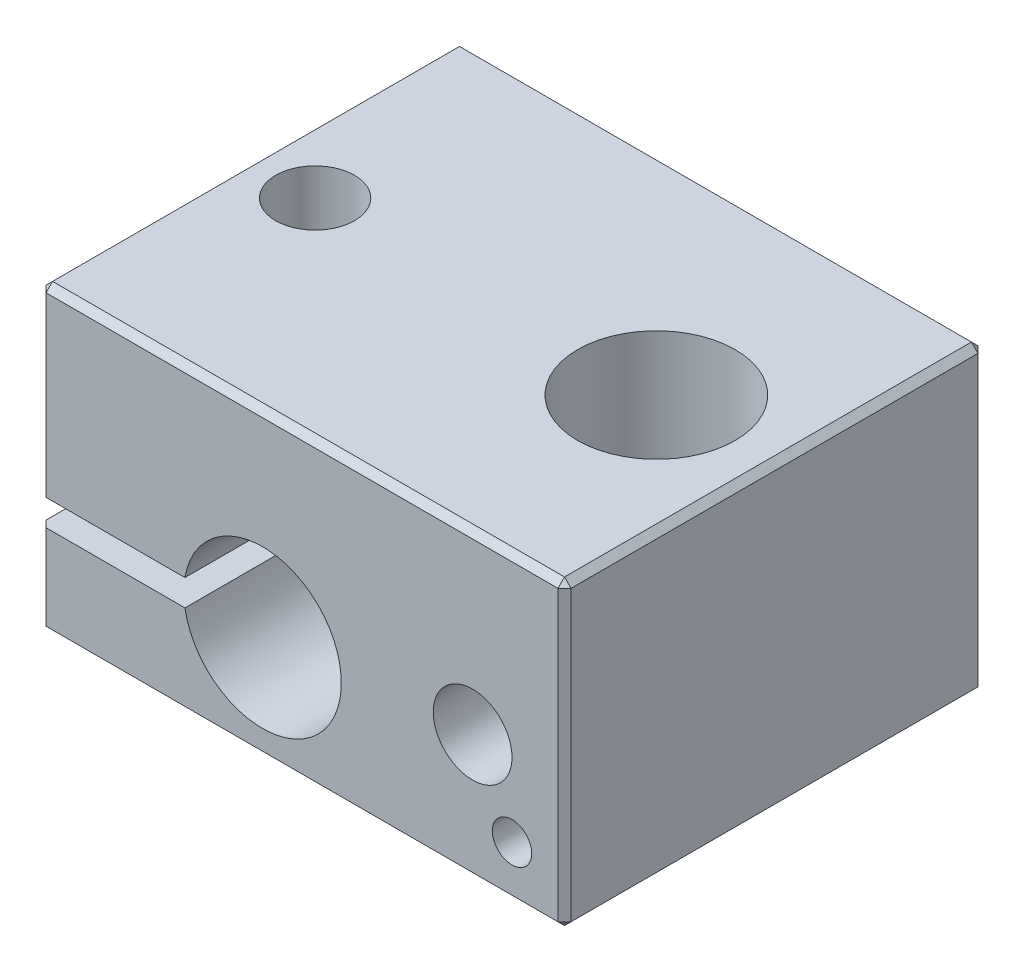
ISO-10303-21;
HEADER;
FILE_DESCRIPTION(('STEP AP214'),'2;1');
FILE_NAME('part.step','',(''),(''),'','','');
FILE_SCHEMA(('AUTOMOTIVE_DESIGN { 1 0 10303 214 1 1 1 1 }'));
ENDSEC;
DATA;
#1=APPLICATION_CONTEXT('core data for automotive mechanical design processes');
#2=APPLICATION_PROTOCOL_DEFINITION('international standard','automotive_design',2000,#1);
#3=PRODUCT_CONTEXT('',#1,'mechanical');
#4=PRODUCT('Part','Part','',(#3));
#5=PRODUCT_RELATED_PRODUCT_CATEGORY('part','',(#4));
#6=PRODUCT_DEFINITION_FORMATION('','',#4);
#7=PRODUCT_DEFINITION_CONTEXT('part definition',#1,'design');
#8=PRODUCT_DEFINITION('design','',#6,#7);
#9=PRODUCT_DEFINITION_SHAPE('','',#8);
#10=(LENGTH_UNIT() NAMED_UNIT(*) SI_UNIT(.MILLI.,.METRE.));
#11=(NAMED_UNIT(*) PLANE_ANGLE_UNIT() SI_UNIT($,.RADIAN.));
#12=(NAMED_UNIT(*) SI_UNIT($,.STERADIAN.) SOLID_ANGLE_UNIT());
#13=UNCERTAINTY_MEASURE_WITH_UNIT(LENGTH_MEASURE(1.E-05),#10,'distance_accuracy_value','');
#14=(GEOMETRIC_REPRESENTATION_CONTEXT(3) GLOBAL_UNCERTAINTY_ASSIGNED_CONTEXT((#13)) GLOBAL_UNIT_ASSIGNED_CONTEXT((#10,
#11,#12)) REPRESENTATION_CONTEXT('',''));
#15=CARTESIAN_POINT('',(0.,0.,0.));
#16=DIRECTION('',(0.,0.,1.));
#17=DIRECTION('',(1.,0.,0.));
#18=AXIS2_PLACEMENT_3D('',#15,#16,#17);
#19=CARTESIAN_POINT('',(7.24900000000001,1.249,3.49999999999999));
#20=DIRECTION('',(0.,0.,1.));
#21=DIRECTION('',(1.,0.,0.));
#22=AXIS2_PLACEMENT_3D('',#19,#20,#21);
#23=PLANE('',#22);
#24=CARTESIAN_POINT('',(8.00000000000001,2.,3.49999999999999));
#25=DIRECTION('',(0.,0.,1.));
#26=DIRECTION('',(0.,-1.,0.));
#27=AXIS2_PLACEMENT_3D('',#24,#25,#26);
#28=CIRCLE('',#27,0.75);
#29=CARTESIAN_POINT('',(8.00000000000001,1.25,3.49999999999999));
#30=VERTEX_POINT('',#29);
#31=EDGE_CURVE('E20',#30,#30,#28,.F.);
#32=ORIENTED_EDGE('',*,*,#31,.F.);
#33=EDGE_LOOP('',(#32));
#34=FACE_BOUND('',#33,.T.);
#35=ADVANCED_FACE('F16',(#34),#23,.T.);
#36=CARTESIAN_POINT('',(4.99900000000001,3.299,4.49999999999999));
#37=DIRECTION('',(0.,0.,1.));
#38=DIRECTION('',(1.,0.,0.));
#39=AXIS2_PLACEMENT_3D('',#36,#37,#38);
#40=PLANE('',#39);
#41=CARTESIAN_POINT('',(6.50000000000001,4.8,4.49999999999999));
#42=DIRECTION('',(0.,0.,1.));
#43=DIRECTION('',(1.,0.,0.));
#44=AXIS2_PLACEMENT_3D('',#41,#42,#43);
#45=CIRCLE('',#44,1.5);
#46=CARTESIAN_POINT('',(8.00000000000001,4.8,4.49999999999999));
#47=VERTEX_POINT('',#46);
#48=EDGE_CURVE('E287',#47,#47,#45,.F.);
#49=ORIENTED_EDGE('',*,*,#48,.F.);
#50=EDGE_LOOP('',(#49));
#51=FACE_BOUND('',#50,.T.);
#52=ADVANCED_FACE('F303',(#51),#40,.T.);
#53=CARTESIAN_POINT('',(-9.74929289321881,0.248999999999997,8.00070710678118));
#54=DIRECTION('',(-0.707106781186515,0.,0.70710678118658));
#55=DIRECTION('',(0.,1.,0.));
#56=AXIS2_PLACEMENT_3D('',#53,#54,#55);
#57=PLANE('',#56);
#58=DIRECTION('',(-0.70710678118649,0.,-0.707106781186605));
#59=VECTOR('',#58,1.);
#60=CARTESIAN_POINT('',(-9.75000000000001,0.249999999999989,8.));
#61=LINE('',#60,#59);
#62=CARTESIAN_POINT('',(-9.75000000000001,0.249999999999994,7.99999999999999));
#63=VERTEX_POINT('',#62);
#64=CARTESIAN_POINT('',(-10.,0.249999999999987,7.74999999999997));
#65=VERTEX_POINT('',#64);
#66=EDGE_CURVE('E277',#63,#65,#61,.T.);
#67=ORIENTED_EDGE('',*,*,#66,.F.);
#68=DIRECTION('',(0.,-1.,0.));
#69=VECTOR('',#68,1.);
#70=CARTESIAN_POINT('',(-9.75,5.75,7.99999999999999));
#71=LINE('',#70,#69);
#72=CARTESIAN_POINT('',(-9.75,3.5,7.99999999999999));
#73=VERTEX_POINT('',#72);
#74=EDGE_CURVE('E221',#73,#63,#71,.T.);
#75=ORIENTED_EDGE('',*,*,#74,.F.);
#76=DIRECTION('',(0.70710678118655,0.,0.707106781186545));
#77=VECTOR('',#76,1.);
#78=CARTESIAN_POINT('',(-10.,3.5,7.74999999999999));
#79=LINE('',#78,#77);
#80=CARTESIAN_POINT('',(-10.,3.5,7.74999999999999));
#81=VERTEX_POINT('',#80);
#82=EDGE_CURVE('E274',#81,#73,#79,.T.);
#83=ORIENTED_EDGE('',*,*,#82,.F.);
#84=DIRECTION('',(0.,1.,0.));
#85=VECTOR('',#84,1.);
#86=CARTESIAN_POINT('',(-9.99999999999999,1.875,7.74999999999999));
#87=LINE('',#86,#85);
#88=EDGE_CURVE('E280',#65,#81,#87,.T.);
#89=ORIENTED_EDGE('',*,*,#88,.F.);
#90=EDGE_LOOP('',(#67,#75,#83,#89));
#91=FACE_BOUND('',#90,.T.);
#92=ADVANCED_FACE('F309',(#91),#57,.T.);
#93=CARTESIAN_POINT('',(8.00000000000001,2.,3.49999999999999));
#94=DIRECTION('',(0.,0.,1.));
#95=DIRECTION('',(0.,-1.,0.));
#96=AXIS2_PLACEMENT_3D('',#93,#94,#95);
#97=CYLINDRICAL_SURFACE('',#96,0.75);
#98=CARTESIAN_POINT('',(8.00000000000001,2.,7.99999999999999));
#99=DIRECTION('',(0.,0.,1.));
#100=DIRECTION('',(0.,-1.,0.));
#101=AXIS2_PLACEMENT_3D('',#98,#99,#100);
#102=CIRCLE('',#101,0.75);
#103=CARTESIAN_POINT('',(8.00000000000001,1.25,7.99999999999999));
#104=VERTEX_POINT('',#103);
#105=EDGE_CURVE('E260',#104,#104,#102,.F.);
#106=ORIENTED_EDGE('',*,*,#105,.F.);
#107=EDGE_LOOP('',(#106));
#108=FACE_BOUND('',#107,.T.);
#109=ORIENTED_EDGE('',*,*,#31,.T.);
#110=EDGE_LOOP('',(#109));
#111=FACE_BOUND('',#110,.T.);
#112=ADVANCED_FACE('F300',(#108,#111),#97,.F.);
#113=CARTESIAN_POINT('',(6.50000000000001,4.8,4.49999999999999));
#114=DIRECTION('',(0.,0.,1.));
#115=DIRECTION('',(1.,0.,0.));
#116=AXIS2_PLACEMENT_3D('',#113,#114,#115);
#117=CYLINDRICAL_SURFACE('',#116,1.5);
#118=CARTESIAN_POINT('',(6.50000000000001,4.8,7.99999999999999));
#119=DIRECTION('',(0.,0.,1.));
#120=DIRECTION('',(1.,0.,0.));
#121=AXIS2_PLACEMENT_3D('',#118,#119,#120);
#122=CIRCLE('',#121,1.5);
#123=CARTESIAN_POINT('',(8.00000000000001,4.8,7.99999999999999));
#124=VERTEX_POINT('',#123);
#125=EDGE_CURVE('E256',#124,#124,#122,.F.);
#126=ORIENTED_EDGE('',*,*,#125,.F.);
#127=EDGE_LOOP('',(#126));
#128=FACE_BOUND('',#127,.T.);
#129=ORIENTED_EDGE('',*,*,#48,.T.);
#130=EDGE_LOOP('',(#129));
#131=FACE_BOUND('',#130,.T.);
#132=ADVANCED_FACE('F659',(#128,#131),#117,.F.);
#133=CARTESIAN_POINT('',(10.0007071067812,0.248999999999997,7.74929289321881));
#134=DIRECTION('',(0.707106781186527,0.,0.707106781186568));
#135=DIRECTION('',(0.,1.,0.));
#136=AXIS2_PLACEMENT_3D('',#133,#134,#135);
#137=PLANE('',#136);
#138=DIRECTION('',(-0.707106781186527,0.,0.707106781186568));
#139=VECTOR('',#138,1.);
#140=CARTESIAN_POINT('',(9.99999999999999,0.250000000000006,7.74999999999999));
#141=LINE('',#140,#139);
#142=CARTESIAN_POINT('',(10.,0.249999999999992,7.74999999999999));
#143=VERTEX_POINT('',#142);
#144=CARTESIAN_POINT('',(9.75000000000001,0.249999999999994,7.99999999999999));
#145=VERTEX_POINT('',#144);
#146=EDGE_CURVE('E185',#143,#145,#141,.T.);
#147=ORIENTED_EDGE('',*,*,#146,.F.);
#148=DIRECTION('',(0.,-1.,0.));
#149=VECTOR('',#148,1.);
#150=CARTESIAN_POINT('',(10.,5.75,7.75));
#151=LINE('',#150,#149);
#152=CARTESIAN_POINT('',(10.,11.25,7.75000000000001));
#153=VERTEX_POINT('',#152);
#154=EDGE_CURVE('E174',#153,#143,#151,.T.);
#155=ORIENTED_EDGE('',*,*,#154,.F.);
#156=DIRECTION('',(0.707106781186605,0.,-0.70710678118649));
#157=VECTOR('',#156,1.);
#158=CARTESIAN_POINT('',(9.87500000000003,11.25,7.875));
#159=LINE('',#158,#157);
#160=CARTESIAN_POINT('',(9.75000000000001,11.25,7.99999999999999));
#161=VERTEX_POINT('',#160);
#162=EDGE_CURVE('E212',#161,#153,#159,.T.);
#163=ORIENTED_EDGE('',*,*,#162,.F.);
#164=DIRECTION('',(0.,1.,0.));
#165=VECTOR('',#164,1.);
#166=CARTESIAN_POINT('',(9.75000000000001,5.75,7.99999999999999));
#167=LINE('',#166,#165);
#168=EDGE_CURVE('E216',#145,#161,#167,.T.);
#169=ORIENTED_EDGE('',*,*,#168,.F.);
#170=EDGE_LOOP('',(#147,#155,#163,#169));
#171=FACE_BOUND('',#170,.T.);
#172=ADVANCED_FACE('F538',(#171),#137,.T.);
#173=CARTESIAN_POINT('',(-10.0007071067812,0.248999999999997,-7.74929289321882));
#174=DIRECTION('',(-0.707106781186529,0.,-0.707106781186566));
#175=DIRECTION('',(0.,1.,0.));
#176=AXIS2_PLACEMENT_3D('',#173,#174,#175);
#177=PLANE('',#176);
#178=DIRECTION('',(0.707106781186529,0.,-0.707106781186566));
#179=VECTOR('',#178,1.);
#180=CARTESIAN_POINT('',(-9.99999999999999,0.250000000000006,-7.75));
#181=LINE('',#180,#179);
#182=CARTESIAN_POINT('',(-10.,0.249999999999989,-7.75));
#183=VERTEX_POINT('',#182);
#184=CARTESIAN_POINT('',(-9.75,0.250000000000001,-8.00000000000001));
#185=VERTEX_POINT('',#184);
#186=EDGE_CURVE('E281',#183,#185,#181,.T.);
#187=ORIENTED_EDGE('',*,*,#186,.F.);
#188=DIRECTION('',(0.,-1.,0.));
#189=VECTOR('',#188,1.);
#190=CARTESIAN_POINT('',(-10.,1.875,-7.75000000000001));
#191=LINE('',#190,#189);
#192=CARTESIAN_POINT('',(-10.,3.5,-7.75000000000001));
#193=VERTEX_POINT('',#192);
#194=EDGE_CURVE('E456',#193,#183,#191,.T.);
#195=ORIENTED_EDGE('',*,*,#194,.F.);
#196=DIRECTION('',(-0.707106781186541,0.,0.707106781186554));
#197=VECTOR('',#196,1.);
#198=CARTESIAN_POINT('',(-9.75,3.5,-8.00000000000001));
#199=LINE('',#198,#197);
#200=CARTESIAN_POINT('',(-9.75,3.5,-8.00000000000001));
#201=VERTEX_POINT('',#200);
#202=EDGE_CURVE('E268',#201,#193,#199,.T.);
#203=ORIENTED_EDGE('',*,*,#202,.F.);
#204=DIRECTION('',(0.,1.,0.));
#205=VECTOR('',#204,1.);
#206=CARTESIAN_POINT('',(-9.75,5.75,-8.00000000000001));
#207=LINE('',#206,#205);
#208=EDGE_CURVE('E374',#185,#201,#207,.T.);
#209=ORIENTED_EDGE('',*,*,#208,.F.);
#210=EDGE_LOOP('',(#187,#195,#203,#209));
#211=FACE_BOUND('',#210,.T.);
#212=ADVANCED_FACE('F653',(#211),#177,.T.);
#213=CARTESIAN_POINT('',(9.74929289321882,0.248999999999997,-8.00070710678119));
#214=DIRECTION('',(0.707106781186527,0.,-0.707106781186568));
#215=DIRECTION('',(0.,1.,0.));
#216=AXIS2_PLACEMENT_3D('',#213,#214,#215);
#217=PLANE('',#216);
#218=DIRECTION('',(-0.707106781186617,0.,-0.707106781186478));
#219=VECTOR('',#218,1.);
#220=CARTESIAN_POINT('',(9.87500000000003,11.25,-7.87500000000001));
#221=LINE('',#220,#219);
#222=CARTESIAN_POINT('',(10.,11.25,-7.75000000000002));
#223=VERTEX_POINT('',#222);
#224=CARTESIAN_POINT('',(9.75000000000001,11.25,-8.00000000000001));
#225=VERTEX_POINT('',#224);
#226=EDGE_CURVE('E167',#223,#225,#221,.T.);
#227=ORIENTED_EDGE('',*,*,#226,.F.);
#228=DIRECTION('',(0.,1.,0.));
#229=VECTOR('',#228,1.);
#230=CARTESIAN_POINT('',(10.,5.75,-7.75000000000001));
#231=LINE('',#230,#229);
#232=CARTESIAN_POINT('',(10.,0.249999999999988,-7.75000000000001));
#233=VERTEX_POINT('',#232);
#234=EDGE_CURVE('E164',#233,#223,#231,.T.);
#235=ORIENTED_EDGE('',*,*,#234,.F.);
#236=DIRECTION('',(0.707106781186535,0.,0.70710678118656));
#237=VECTOR('',#236,1.);
#238=CARTESIAN_POINT('',(9.75000000000001,0.249999999999999,-8.00000000000001));
#239=LINE('',#238,#237);
#240=CARTESIAN_POINT('',(9.75000000000001,0.25,-8.00000000000001));
#241=VERTEX_POINT('',#240);
#242=EDGE_CURVE('E161',#241,#233,#239,.T.);
#243=ORIENTED_EDGE('',*,*,#242,.F.);
#244=DIRECTION('',(0.,-1.,0.));
#245=VECTOR('',#244,1.);
#246=CARTESIAN_POINT('',(9.75000000000001,5.75,-8.00000000000001));
#247=LINE('',#246,#245);
#248=EDGE_CURVE('E397',#225,#241,#247,.T.);
#249=ORIENTED_EDGE('',*,*,#248,.F.);
#250=EDGE_LOOP('',(#227,#235,#243,#249));
#251=FACE_BOUND('',#250,.T.);
#252=ADVANCED_FACE('F165',(#251),#217,.T.);
#253=CARTESIAN_POINT('',(-9.74929289321881,4.499,8.00070710678118));
#254=DIRECTION('',(-0.707106781186515,0.,0.70710678118658));
#255=DIRECTION('',(0.,1.,0.));
#256=AXIS2_PLACEMENT_3D('',#253,#254,#255);
#257=PLANE('',#256);
#258=DIRECTION('',(-0.70710678118658,0.,-0.707106781186515));
#259=VECTOR('',#258,1.);
#260=CARTESIAN_POINT('',(-9.87500000000001,11.25,7.875));
#261=LINE('',#260,#259);
#262=CARTESIAN_POINT('',(-9.75,11.25,7.99999999999999));
#263=VERTEX_POINT('',#262);
#264=CARTESIAN_POINT('',(-10.,11.25,7.75));
#265=VERTEX_POINT('',#264);
#266=EDGE_CURVE('E294',#263,#265,#261,.T.);
#267=ORIENTED_EDGE('',*,*,#266,.T.);
#268=DIRECTION('',(0.,1.,0.));
#269=VECTOR('',#268,1.);
#270=CARTESIAN_POINT('',(-9.99999999999999,7.875,7.74999999999999));
#271=LINE('',#270,#269);
#272=CARTESIAN_POINT('',(-10.,4.5,7.75));
#273=VERTEX_POINT('',#272);
#274=EDGE_CURVE('E416',#273,#265,#271,.T.);
#275=ORIENTED_EDGE('',*,*,#274,.F.);
#276=DIRECTION('',(0.707106781186583,0.,0.707106781186512));
#277=VECTOR('',#276,1.);
#278=CARTESIAN_POINT('',(-9.87500000000001,4.5,7.875));
#279=LINE('',#278,#277);
#280=CARTESIAN_POINT('',(-9.75,4.5,7.99999999999999));
#281=VERTEX_POINT('',#280);
#282=EDGE_CURVE('E290',#273,#281,#279,.T.);
#283=ORIENTED_EDGE('',*,*,#282,.T.);
#284=DIRECTION('',(0.,-1.,0.));
#285=VECTOR('',#284,1.);
#286=CARTESIAN_POINT('',(-9.75,5.75,7.99999999999999));
#287=LINE('',#286,#285);
#288=EDGE_CURVE('E220',#263,#281,#287,.T.);
#289=ORIENTED_EDGE('',*,*,#288,.F.);
#290=EDGE_LOOP('',(#267,#275,#283,#289));
#291=FACE_BOUND('',#290,.T.);
#292=ADVANCED_FACE('F639',(#291),#257,.T.);
#293=CARTESIAN_POINT('',(-10.0007071067812,4.499,-7.74929289321882));
#294=DIRECTION('',(-0.707106781186515,0.,-0.70710678118658));
#295=DIRECTION('',(0.,1.,0.));
#296=AXIS2_PLACEMENT_3D('',#293,#294,#295);
#297=PLANE('',#296);
#298=DIRECTION('',(-0.707106781186483,0.,0.707106781186612));
#299=VECTOR('',#298,1.);
#300=CARTESIAN_POINT('',(-9.87499999999998,11.25,-7.87500000000002));
#301=LINE('',#300,#299);
#302=CARTESIAN_POINT('',(-9.75,11.25,-8.00000000000001));
#303=VERTEX_POINT('',#302);
#304=CARTESIAN_POINT('',(-10.,11.25,-7.75000000000001));
#305=VERTEX_POINT('',#304);
#306=EDGE_CURVE('E414',#303,#305,#301,.T.);
#307=ORIENTED_EDGE('',*,*,#306,.F.);
#308=DIRECTION('',(0.,1.,0.));
#309=VECTOR('',#308,1.);
#310=CARTESIAN_POINT('',(-9.75,5.75,-8.00000000000001));
#311=LINE('',#310,#309);
#312=CARTESIAN_POINT('',(-9.75,4.5,-8.00000000000001));
#313=VERTEX_POINT('',#312);
#314=EDGE_CURVE('E254',#313,#303,#311,.T.);
#315=ORIENTED_EDGE('',*,*,#314,.F.);
#316=DIRECTION('',(-0.707106781186583,0.,0.707106781186512));
#317=VECTOR('',#316,1.);
#318=CARTESIAN_POINT('',(-9.87500000000001,4.5,-7.87500000000001));
#319=LINE('',#318,#317);
#320=CARTESIAN_POINT('',(-10.,4.5,-7.75000000000002));
#321=VERTEX_POINT('',#320);
#322=EDGE_CURVE('E186',#313,#321,#319,.T.);
#323=ORIENTED_EDGE('',*,*,#322,.T.);
#324=DIRECTION('',(0.,-1.,0.));
#325=VECTOR('',#324,1.);
#326=CARTESIAN_POINT('',(-10.,7.875,-7.75000000000001));
#327=LINE('',#326,#325);
#328=EDGE_CURVE('E403',#305,#321,#327,.T.);
#329=ORIENTED_EDGE('',*,*,#328,.F.);
#330=EDGE_LOOP('',(#307,#315,#323,#329));
#331=FACE_BOUND('',#330,.T.);
#332=ADVANCED_FACE('F641',(#331),#297,.T.);
#333=CARTESIAN_POINT('',(-1.49999999999999,3.99999999999999,-8.00000000000001));
#334=DIRECTION('',(0.,0.,1.));
#335=DIRECTION('',(1.,0.,0.));
#336=AXIS2_PLACEMENT_3D('',#333,#334,#335);
#337=CYLINDRICAL_SURFACE('',#336,3.);
#338=CARTESIAN_POINT('',(-1.49999999999999,3.99999999999999,7.99999999999999));
#339=DIRECTION('',(0.,0.,1.));
#340=DIRECTION('',(1.,0.,0.));
#341=AXIS2_PLACEMENT_3D('',#338,#339,#340);
#342=CIRCLE('',#341,3.);
#343=CARTESIAN_POINT('',(-4.4580398915498,4.5,7.99999999999999));
#344=VERTEX_POINT('',#343);
#345=CARTESIAN_POINT('',(-4.4580398915498,3.5,7.99999999999999));
#346=VERTEX_POINT('',#345);
#347=EDGE_CURVE('E264',#344,#346,#342,.F.);
#348=ORIENTED_EDGE('',*,*,#347,.F.);
#349=DIRECTION('',(0.,0.,1.));
#350=VECTOR('',#349,1.);
#351=CARTESIAN_POINT('',(-4.4580398915498,4.5,0.));
#352=LINE('',#351,#350);
#353=CARTESIAN_POINT('',(-4.4580398915498,4.5,-8.00000000000001));
#354=VERTEX_POINT('',#353);
#355=EDGE_CURVE('E382',#354,#344,#352,.T.);
#356=ORIENTED_EDGE('',*,*,#355,.F.);
#357=CARTESIAN_POINT('',(-1.49999999999999,3.99999999999999,-8.00000000000001));
#358=DIRECTION('',(0.,0.,1.));
#359=DIRECTION('',(1.,0.,0.));
#360=AXIS2_PLACEMENT_3D('',#357,#358,#359);
#361=CIRCLE('',#360,3.);
#362=CARTESIAN_POINT('',(-4.4580398915498,3.5,-8.00000000000001));
#363=VERTEX_POINT('',#362);
#364=EDGE_CURVE('E251',#363,#354,#361,.T.);
#365=ORIENTED_EDGE('',*,*,#364,.F.);
#366=DIRECTION('',(0.,0.,-1.));
#367=VECTOR('',#366,1.);
#368=CARTESIAN_POINT('',(-4.4580398915498,3.5,0.));
#369=LINE('',#368,#367);
#370=EDGE_CURVE('E273',#346,#363,#369,.T.);
#371=ORIENTED_EDGE('',*,*,#370,.F.);
#372=EDGE_LOOP('',(#348,#356,#365,#371));
#373=FACE_BOUND('',#372,.T.);
#374=ADVANCED_FACE('F557',(#373),#337,.F.);
#375=CARTESIAN_POINT('',(9.62388464492836,0.124701141509275,-8.00081649658093));
#376=DIRECTION('',(0.577350269189631,-0.577350269189631,-0.577350269189615));
#377=DIRECTION('',(0.707106781186547,0.707106781186547,0.));
#378=AXIS2_PLACEMENT_3D('',#375,#376,#377);
#379=PLANE('',#378);
#380=ORIENTED_EDGE('',*,*,#242,.T.);
#381=DIRECTION('',(0.707106781186563,0.707106781186532,0.));
#382=VECTOR('',#381,1.);
#383=CARTESIAN_POINT('',(9.87500000000001,0.124999999999999,-7.75000000000001));
#384=LINE('',#383,#382);
#385=CARTESIAN_POINT('',(9.75,0.,-7.75000000000001));
#386=VERTEX_POINT('',#385);
#387=EDGE_CURVE('E180',#386,#233,#384,.T.);
#388=ORIENTED_EDGE('',*,*,#387,.F.);
#389=DIRECTION('',(0.,-0.707106781186549,0.707106781186546));
#390=VECTOR('',#389,1.);
#391=CARTESIAN_POINT('',(9.75000000000001,0.124999999999998,-7.87500000000001));
#392=LINE('',#391,#390);
#393=EDGE_CURVE('E182',#241,#386,#392,.T.);
#394=ORIENTED_EDGE('',*,*,#393,.F.);
#395=EDGE_LOOP('',(#380,#388,#394));
#396=FACE_BOUND('',#395,.T.);
#397=ADVANCED_FACE('F178',(#396),#379,.T.);
#398=CARTESIAN_POINT('',(9.74918350341908,0.250298858490719,8.00111535507164));
#399=DIRECTION('',(0.577350269189664,-0.577350269189605,0.577350269189608));
#400=DIRECTION('',(0.,-0.707106781186549,-0.707106781186546));
#401=AXIS2_PLACEMENT_3D('',#398,#399,#400);
#402=PLANE('',#401);
#403=DIRECTION('',(-0.707106781186563,-0.707106781186532,0.));
#404=VECTOR('',#403,1.);
#405=CARTESIAN_POINT('',(9.87500000000001,0.124999999999999,7.75));
#406=LINE('',#405,#404);
#407=CARTESIAN_POINT('',(9.75000000000001,0.,7.74999999999999));
#408=VERTEX_POINT('',#407);
#409=EDGE_CURVE('E196',#143,#408,#406,.T.);
#410=ORIENTED_EDGE('',*,*,#409,.F.);
#411=ORIENTED_EDGE('',*,*,#146,.T.);
#412=DIRECTION('',(0.,0.707106781186549,0.707106781186545));
#413=VECTOR('',#412,1.);
#414=CARTESIAN_POINT('',(9.75000000000001,0.124999999999998,7.875));
#415=LINE('',#414,#413);
#416=EDGE_CURVE('E222',#408,#145,#415,.T.);
#417=ORIENTED_EDGE('',*,*,#416,.F.);
#418=EDGE_LOOP('',(#410,#411,#417));
#419=FACE_BOUND('',#418,.T.);
#420=ADVANCED_FACE('F546',(#419),#402,.T.);
#421=CARTESIAN_POINT('',(-10.0008164965809,0.124701141509277,-7.62388464492836));
#422=DIRECTION('',(-0.577350269189654,-0.577350269189616,-0.577350269189607));
#423=DIRECTION('',(0.,0.707106781186542,-0.707106781186553));
#424=AXIS2_PLACEMENT_3D('',#421,#422,#423);
#425=PLANE('',#424);
#426=ORIENTED_EDGE('',*,*,#186,.T.);
#427=DIRECTION('',(0.,0.707106781186547,-0.707106781186548));
#428=VECTOR('',#427,1.);
#429=CARTESIAN_POINT('',(-9.74999999999999,0.124999999999998,-7.87500000000001));
#430=LINE('',#429,#428);
#431=CARTESIAN_POINT('',(-9.74999999999999,0.,-7.75000000000001));
#432=VERTEX_POINT('',#431);
#433=EDGE_CURVE('E386',#432,#185,#430,.T.);
#434=ORIENTED_EDGE('',*,*,#433,.F.);
#435=DIRECTION('',(0.707106781186576,-0.707106781186519,0.));
#436=VECTOR('',#435,1.);
#437=CARTESIAN_POINT('',(-9.87500000000001,0.124999999999998,-7.75000000000001));
#438=LINE('',#437,#436);
#439=EDGE_CURVE('E461',#183,#432,#438,.T.);
#440=ORIENTED_EDGE('',*,*,#439,.F.);
#441=EDGE_LOOP('',(#426,#434,#440));
#442=FACE_BOUND('',#441,.T.);
#443=ADVANCED_FACE('F548',(#442),#425,.T.);
#444=CARTESIAN_POINT('',(-10.0011153550716,0.250298858490719,7.74918350341907));
#445=DIRECTION('',(-0.577350269189704,-0.577350269189614,0.577350269189559));
#446=DIRECTION('',(0.707106781186492,-0.707106781186603,0.));
#447=AXIS2_PLACEMENT_3D('',#444,#445,#446);
#448=PLANE('',#447);
#449=DIRECTION('',(-0.707106781186591,0.707106781186504,0.));
#450=VECTOR('',#449,1.);
#451=CARTESIAN_POINT('',(-9.875,0.124999999999998,7.74999999999999));
#452=LINE('',#451,#450);
#453=CARTESIAN_POINT('',(-9.74999999999999,0.,7.74999999999999));
#454=VERTEX_POINT('',#453);
#455=EDGE_CURVE('E465',#454,#65,#452,.T.);
#456=ORIENTED_EDGE('',*,*,#455,.F.);
#457=DIRECTION('',(0.,-0.707106781186549,-0.707106781186545));
#458=VECTOR('',#457,1.);
#459=CARTESIAN_POINT('',(-9.75,0.124999999999998,7.875));
#460=LINE('',#459,#458);
#461=EDGE_CURVE('E215',#63,#454,#460,.T.);
#462=ORIENTED_EDGE('',*,*,#461,.F.);
#463=ORIENTED_EDGE('',*,*,#66,.T.);
#464=EDGE_LOOP('',(#456,#462,#463));
#465=FACE_BOUND('',#464,.T.);
#466=ADVANCED_FACE('F554',(#465),#448,.T.);
#467=CARTESIAN_POINT('',(-10.,0.248999999999997,-7.75100000000001));
#468=DIRECTION('',(-1.,0.,0.));
#469=DIRECTION('',(0.,0.,1.));
#470=AXIS2_PLACEMENT_3D('',#467,#468,#469);
#471=PLANE('',#470);
#472=DIRECTION('',(0.,0.,1.));
#473=VECTOR('',#472,1.);
#474=CARTESIAN_POINT('',(-10.,3.5,0.));
#475=LINE('',#474,#473);
#476=EDGE_CURVE('E276',#193,#81,#475,.T.);
#477=ORIENTED_EDGE('',*,*,#476,.F.);
#478=ORIENTED_EDGE('',*,*,#194,.T.);
#479=DIRECTION('',(0.,0.,-1.));
#480=VECTOR('',#479,1.);
#481=CARTESIAN_POINT('',(-10.,0.249999999999987,0.));
#482=LINE('',#481,#480);
#483=EDGE_CURVE('E250',#65,#183,#482,.T.);
#484=ORIENTED_EDGE('',*,*,#483,.F.);
#485=ORIENTED_EDGE('',*,*,#88,.T.);
#486=EDGE_LOOP('',(#477,#478,#484,#485));
#487=FACE_BOUND('',#486,.T.);
#488=ADVANCED_FACE('F563',(#487),#471,.T.);
#489=CARTESIAN_POINT('',(-4.4570398915498,3.5,-8.00100000000001));
#490=DIRECTION('',(0.,1.,0.));
#491=DIRECTION('',(-1.,0.,0.));
#492=AXIS2_PLACEMENT_3D('',#489,#490,#491);
#493=PLANE('',#492);
#494=CARTESIAN_POINT('',(-7.5,3.5,0.));
#495=DIRECTION('',(0.,1.,0.));
#496=DIRECTION('',(0.,0.,1.));
#497=AXIS2_PLACEMENT_3D('',#494,#495,#496);
#498=CIRCLE('',#497,1.5);
#499=CARTESIAN_POINT('',(-7.5,3.5,1.49999999999999));
#500=VERTEX_POINT('',#499);
#501=EDGE_CURVE('E245',#500,#500,#498,.T.);
#502=ORIENTED_EDGE('',*,*,#501,.F.);
#503=EDGE_LOOP('',(#502));
#504=FACE_BOUND('',#503,.T.);
#505=DIRECTION('',(1.,0.,0.));
#506=VECTOR('',#505,1.);
#507=CARTESIAN_POINT('',(0.,3.5,-8.00000000000001));
#508=LINE('',#507,#506);
#509=EDGE_CURVE('E255',#201,#363,#508,.T.);
#510=ORIENTED_EDGE('',*,*,#509,.F.);
#511=ORIENTED_EDGE('',*,*,#202,.T.);
#512=ORIENTED_EDGE('',*,*,#476,.T.);
#513=ORIENTED_EDGE('',*,*,#82,.T.);
#514=DIRECTION('',(-1.,0.,0.));
#515=VECTOR('',#514,1.);
#516=CARTESIAN_POINT('',(0.,3.5,7.99999999999999));
#517=LINE('',#516,#515);
#518=EDGE_CURVE('E272',#346,#73,#517,.T.);
#519=ORIENTED_EDGE('',*,*,#518,.F.);
#520=ORIENTED_EDGE('',*,*,#370,.T.);
#521=EDGE_LOOP('',(#510,#511,#512,#513,#519,#520));
#522=FACE_BOUND('',#521,.T.);
#523=ADVANCED_FACE('F567',(#504,#522),#493,.T.);
#524=CARTESIAN_POINT('',(-9.751,0.248999999999997,7.99999999999999));
#525=DIRECTION('',(0.,0.,1.));
#526=DIRECTION('',(1.,0.,0.));
#527=AXIS2_PLACEMENT_3D('',#524,#525,#526);
#528=PLANE('',#527);
#529=ORIENTED_EDGE('',*,*,#125,.T.);
#530=EDGE_LOOP('',(#529));
#531=FACE_BOUND('',#530,.T.);
#532=ORIENTED_EDGE('',*,*,#105,.T.);
#533=EDGE_LOOP('',(#532));
#534=FACE_BOUND('',#533,.T.);
#535=DIRECTION('',(-1.,0.,0.));
#536=VECTOR('',#535,1.);
#537=CARTESIAN_POINT('',(-7.2290199457749,4.5,7.99999999999999));
#538=LINE('',#537,#536);
#539=EDGE_CURVE('E400',#344,#281,#538,.T.);
#540=ORIENTED_EDGE('',*,*,#539,.F.);
#541=ORIENTED_EDGE('',*,*,#347,.T.);
#542=ORIENTED_EDGE('',*,*,#518,.T.);
#543=ORIENTED_EDGE('',*,*,#74,.T.);
#544=DIRECTION('',(-1.,0.,0.));
#545=VECTOR('',#544,1.);
#546=CARTESIAN_POINT('',(0.,0.249999999999995,7.99999999999999));
#547=LINE('',#546,#545);
#548=EDGE_CURVE('E225',#145,#63,#547,.T.);
#549=ORIENTED_EDGE('',*,*,#548,.F.);
#550=ORIENTED_EDGE('',*,*,#168,.T.);
#551=DIRECTION('',(1.,0.,0.));
#552=VECTOR('',#551,1.);
#553=CARTESIAN_POINT('',(0.,11.25,7.99999999999998));
#554=LINE('',#553,#552);
#555=EDGE_CURVE('E370',#263,#161,#554,.T.);
#556=ORIENTED_EDGE('',*,*,#555,.F.);
#557=ORIENTED_EDGE('',*,*,#288,.T.);
#558=EDGE_LOOP('',(#540,#541,#542,#543,#549,#550,#556,#557));
#559=FACE_BOUND('',#558,.T.);
#560=ADVANCED_FACE('F542',(#531,#534,#559),#528,.T.);
#561=CARTESIAN_POINT('',(9.74970114150928,11.2491835034191,8.00111535507165));
#562=DIRECTION('',(0.577350269189545,0.577350269189692,0.57735026918964));
#563=DIRECTION('',(0.707106781186606,0.,-0.707106781186489));
#564=AXIS2_PLACEMENT_3D('',#561,#562,#563);
#565=PLANE('',#564);
#566=DIRECTION('',(0.,0.707106781186594,-0.707106781186501));
#567=VECTOR('',#566,1.);
#568=CARTESIAN_POINT('',(9.75000000000001,11.375,7.875));
#569=LINE('',#568,#567);
#570=CARTESIAN_POINT('',(9.75000000020413,11.4999999997959,7.75));
#571=VERTEX_POINT('',#570);
#572=EDGE_CURVE('E366',#161,#571,#569,.T.);
#573=ORIENTED_EDGE('',*,*,#572,.F.);
#574=ORIENTED_EDGE('',*,*,#162,.T.);
#575=DIRECTION('',(0.707106781186504,-0.707106781186591,0.));
#576=VECTOR('',#575,1.);
#577=CARTESIAN_POINT('',(9.87500000000002,11.375,7.75));
#578=LINE('',#577,#576);
#579=EDGE_CURVE('E358',#571,#153,#578,.T.);
#580=ORIENTED_EDGE('',*,*,#579,.F.);
#581=EDGE_LOOP('',(#573,#574,#580));
#582=FACE_BOUND('',#581,.T.);
#583=ADVANCED_FACE('F536',(#582),#565,.T.);
#584=CARTESIAN_POINT('',(10.,0.248999999999997,7.751));
#585=DIRECTION('',(1.,0.,0.));
#586=DIRECTION('',(0.,0.,-1.));
#587=AXIS2_PLACEMENT_3D('',#584,#585,#586);
#588=PLANE('',#587);
#589=DIRECTION('',(0.,0.,1.));
#590=VECTOR('',#589,1.);
#591=CARTESIAN_POINT('',(10.,0.249999999999991,0.));
#592=LINE('',#591,#590);
#593=EDGE_CURVE('E190',#233,#143,#592,.T.);
#594=ORIENTED_EDGE('',*,*,#593,.F.);
#595=ORIENTED_EDGE('',*,*,#234,.T.);
#596=DIRECTION('',(0.,0.,-1.));
#597=VECTOR('',#596,1.);
#598=CARTESIAN_POINT('',(10.,11.25,0.));
#599=LINE('',#598,#597);
#600=EDGE_CURVE('E355',#153,#223,#599,.T.);
#601=ORIENTED_EDGE('',*,*,#600,.F.);
#602=ORIENTED_EDGE('',*,*,#154,.T.);
#603=EDGE_LOOP('',(#594,#595,#601,#602));
#604=FACE_BOUND('',#603,.T.);
#605=ADVANCED_FACE('F191',(#604),#588,.T.);
#606=CARTESIAN_POINT('',(10.0011153550717,11.2491835034191,-7.74970114150929));
#607=DIRECTION('',(0.577350269189494,0.577350269189772,-0.577350269189612));
#608=DIRECTION('',(-0.70710678118662,0.,-0.707106781186476));
#609=AXIS2_PLACEMENT_3D('',#606,#607,#608);
#610=PLANE('',#609);
#611=DIRECTION('',(0.,-0.70710678118658,-0.707106781186515));
#612=VECTOR('',#611,1.);
#613=CARTESIAN_POINT('',(9.75000000000001,11.375,-7.87500000000001));
#614=LINE('',#613,#612);
#615=CARTESIAN_POINT('',(9.75000000000001,11.4999999997959,-7.75000000020413));
#616=VERTEX_POINT('',#615);
#617=EDGE_CURVE('E350',#616,#225,#614,.T.);
#618=ORIENTED_EDGE('',*,*,#617,.F.);
#619=DIRECTION('',(-0.707106781186521,0.707106781186574,0.));
#620=VECTOR('',#619,1.);
#621=CARTESIAN_POINT('',(9.87500000000001,11.375,-7.75000000000001));
#622=LINE('',#621,#620);
#623=EDGE_CURVE('E362',#223,#616,#622,.T.);
#624=ORIENTED_EDGE('',*,*,#623,.F.);
#625=ORIENTED_EDGE('',*,*,#226,.T.);
#626=EDGE_LOOP('',(#618,#624,#625));
#627=FACE_BOUND('',#626,.T.);
#628=ADVANCED_FACE('F504',(#627),#610,.T.);
#629=CARTESIAN_POINT('',(9.75100000000001,0.248999999999997,-8.00000000000001));
#630=DIRECTION('',(0.,0.,-1.));
#631=DIRECTION('',(-1.,0.,0.));
#632=AXIS2_PLACEMENT_3D('',#629,#630,#631);
#633=PLANE('',#632);
#634=DIRECTION('',(-1.,0.,0.));
#635=VECTOR('',#634,1.);
#636=CARTESIAN_POINT('',(0.,11.25,-8.00000000000001));
#637=LINE('',#636,#635);
#638=EDGE_CURVE('E349',#225,#303,#637,.T.);
#639=ORIENTED_EDGE('',*,*,#638,.F.);
#640=ORIENTED_EDGE('',*,*,#248,.T.);
#641=DIRECTION('',(1.,0.,0.));
#642=VECTOR('',#641,1.);
#643=CARTESIAN_POINT('',(0.,0.25,-8.00000000000001));
#644=LINE('',#643,#642);
#645=EDGE_CURVE('E207',#185,#241,#644,.T.);
#646=ORIENTED_EDGE('',*,*,#645,.F.);
#647=ORIENTED_EDGE('',*,*,#208,.T.);
#648=ORIENTED_EDGE('',*,*,#509,.T.);
#649=ORIENTED_EDGE('',*,*,#364,.T.);
#650=DIRECTION('',(1.,0.,0.));
#651=VECTOR('',#650,1.);
#652=CARTESIAN_POINT('',(-7.2290199457749,4.5,-8.00000000000001));
#653=LINE('',#652,#651);
#654=EDGE_CURVE('E387',#313,#354,#653,.T.);
#655=ORIENTED_EDGE('',*,*,#654,.F.);
#656=ORIENTED_EDGE('',*,*,#314,.T.);
#657=EDGE_LOOP('',(#639,#640,#646,#647,#648,#649,#655,#656));
#658=FACE_BOUND('',#657,.T.);
#659=ADVANCED_FACE('F502',(#658),#633,.T.);
#660=CARTESIAN_POINT('',(-9.74970114150928,11.2491835034191,-8.00111535507166));
#661=DIRECTION('',(-0.577350269189639,0.577350269189708,-0.57735026918953));
#662=DIRECTION('',(-0.707106781186481,0.,0.707106781186615));
#663=AXIS2_PLACEMENT_3D('',#660,#661,#662);
#664=PLANE('',#663);
#665=ORIENTED_EDGE('',*,*,#306,.T.);
#666=DIRECTION('',(-0.707106781186533,-0.707106781186562,0.));
#667=VECTOR('',#666,1.);
#668=CARTESIAN_POINT('',(-9.87500000000001,11.375,-7.75000000000001));
#669=LINE('',#668,#667);
#670=CARTESIAN_POINT('',(-9.74999999999999,11.4999999997959,-7.75000000020413));
#671=VERTEX_POINT('',#670);
#672=EDGE_CURVE('E36',#671,#305,#669,.T.);
#673=ORIENTED_EDGE('',*,*,#672,.F.);
#674=DIRECTION('',(0.,0.707106781186579,0.707106781186516));
#675=VECTOR('',#674,1.);
#676=CARTESIAN_POINT('',(-9.75,11.375,-7.87500000000001));
#677=LINE('',#676,#675);
#678=EDGE_CURVE('E354',#303,#671,#677,.T.);
#679=ORIENTED_EDGE('',*,*,#678,.F.);
#680=EDGE_LOOP('',(#665,#673,#679));
#681=FACE_BOUND('',#680,.T.);
#682=ADVANCED_FACE('F583',(#681),#664,.T.);
#683=CARTESIAN_POINT('',(-10.,4.499,-7.75100000000001));
#684=DIRECTION('',(-1.,0.,0.));
#685=DIRECTION('',(0.,0.,1.));
#686=AXIS2_PLACEMENT_3D('',#683,#684,#685);
#687=PLANE('',#686);
#688=DIRECTION('',(0.,0.,1.));
#689=VECTOR('',#688,1.);
#690=CARTESIAN_POINT('',(-10.,11.25,0.));
#691=LINE('',#690,#689);
#692=EDGE_CURVE('E348',#305,#265,#691,.T.);
#693=ORIENTED_EDGE('',*,*,#692,.F.);
#694=ORIENTED_EDGE('',*,*,#328,.T.);
#695=DIRECTION('',(0.,0.,-1.));
#696=VECTOR('',#695,1.);
#697=CARTESIAN_POINT('',(-10.,4.5,0.));
#698=LINE('',#697,#696);
#699=EDGE_CURVE('E391',#273,#321,#698,.T.);
#700=ORIENTED_EDGE('',*,*,#699,.F.);
#701=ORIENTED_EDGE('',*,*,#274,.T.);
#702=EDGE_LOOP('',(#693,#694,#700,#701));
#703=FACE_BOUND('',#702,.T.);
#704=ADVANCED_FACE('F586',(#703),#687,.T.);
#705=CARTESIAN_POINT('',(-10.0011153550716,11.2491835034191,7.74970114150927));
#706=DIRECTION('',(-0.577350269189685,0.577350269189639,0.577350269189553));
#707=DIRECTION('',(0.707106781186467,0.,0.707106781186628));
#708=AXIS2_PLACEMENT_3D('',#705,#706,#707);
#709=PLANE('',#708);
#710=ORIENTED_EDGE('',*,*,#266,.F.);
#711=DIRECTION('',(0.,-0.707106781186595,0.7071067811865));
#712=VECTOR('',#711,1.);
#713=CARTESIAN_POINT('',(-9.75,11.375,7.875));
#714=LINE('',#713,#712);
#715=CARTESIAN_POINT('',(-9.75000000020412,11.4999999997959,7.75));
#716=VERTEX_POINT('',#715);
#717=EDGE_CURVE('E249',#716,#263,#714,.T.);
#718=ORIENTED_EDGE('',*,*,#717,.F.);
#719=DIRECTION('',(0.707106781186533,0.707106781186562,0.));
#720=VECTOR('',#719,1.);
#721=CARTESIAN_POINT('',(-9.87500000000001,11.375,7.74999999999999));
#722=LINE('',#721,#720);
#723=EDGE_CURVE('E244',#265,#716,#722,.T.);
#724=ORIENTED_EDGE('',*,*,#723,.F.);
#725=EDGE_LOOP('',(#710,#718,#724));
#726=FACE_BOUND('',#725,.T.);
#727=ADVANCED_FACE('F529',(#726),#709,.T.);
#728=CARTESIAN_POINT('',(-10.001,4.5,-8.00100000000001));
#729=DIRECTION('',(0.,-1.,0.));
#730=DIRECTION('',(1.,0.,0.));
#731=AXIS2_PLACEMENT_3D('',#728,#729,#730);
#732=PLANE('',#731);
#733=CARTESIAN_POINT('',(-7.5,4.5,0.));
#734=DIRECTION('',(0.,1.,0.));
#735=DIRECTION('',(0.,0.,1.));
#736=AXIS2_PLACEMENT_3D('',#733,#734,#735);
#737=CIRCLE('',#736,1.5);
#738=CARTESIAN_POINT('',(-7.5,4.5,1.49999999999999));
#739=VERTEX_POINT('',#738);
#740=EDGE_CURVE('E240',#739,#739,#737,.F.);
#741=ORIENTED_EDGE('',*,*,#740,.F.);
#742=EDGE_LOOP('',(#741));
#743=FACE_BOUND('',#742,.T.);
#744=ORIENTED_EDGE('',*,*,#654,.T.);
#745=ORIENTED_EDGE('',*,*,#355,.T.);
#746=ORIENTED_EDGE('',*,*,#539,.T.);
#747=ORIENTED_EDGE('',*,*,#282,.F.);
#748=ORIENTED_EDGE('',*,*,#699,.T.);
#749=ORIENTED_EDGE('',*,*,#322,.F.);
#750=EDGE_LOOP('',(#744,#745,#746,#747,#748,#749));
#751=FACE_BOUND('',#750,.T.);
#752=ADVANCED_FACE('F592',(#743,#751),#732,.T.);
#753=CARTESIAN_POINT('',(-9.751,0.250707106781183,-8.00070710678119));
#754=DIRECTION('',(0.,-0.707106781186546,-0.707106781186549));
#755=DIRECTION('',(1.,0.,0.));
#756=AXIS2_PLACEMENT_3D('',#753,#754,#755);
#757=PLANE('',#756);
#758=ORIENTED_EDGE('',*,*,#393,.T.);
#759=DIRECTION('',(1.,0.,0.));
#760=VECTOR('',#759,1.);
#761=CARTESIAN_POINT('',(0.,0.,-7.75000000000001));
#762=LINE('',#761,#760);
#763=EDGE_CURVE('E243',#432,#386,#762,.T.);
#764=ORIENTED_EDGE('',*,*,#763,.F.);
#765=ORIENTED_EDGE('',*,*,#433,.T.);
#766=ORIENTED_EDGE('',*,*,#645,.T.);
#767=EDGE_LOOP('',(#758,#764,#765,#766));
#768=FACE_BOUND('',#767,.T.);
#769=ADVANCED_FACE('F595',(#768),#757,.T.);
#770=CARTESIAN_POINT('',(10.0007071067812,0.250707106781185,-7.75100000000001));
#771=DIRECTION('',(0.707106781186532,-0.707106781186563,0.));
#772=DIRECTION('',(0.,0.,1.));
#773=AXIS2_PLACEMENT_3D('',#770,#771,#772);
#774=PLANE('',#773);
#775=ORIENTED_EDGE('',*,*,#409,.T.);
#776=DIRECTION('',(0.,0.,1.));
#777=VECTOR('',#776,1.);
#778=CARTESIAN_POINT('',(9.75,0.,0.));
#779=LINE('',#778,#777);
#780=EDGE_CURVE('E201',#386,#408,#779,.T.);
#781=ORIENTED_EDGE('',*,*,#780,.F.);
#782=ORIENTED_EDGE('',*,*,#387,.T.);
#783=ORIENTED_EDGE('',*,*,#593,.T.);
#784=EDGE_LOOP('',(#775,#781,#782,#783));
#785=FACE_BOUND('',#784,.T.);
#786=ADVANCED_FACE('F199',(#785),#774,.T.);
#787=CARTESIAN_POINT('',(9.75100000000001,0.250707106781183,8.00070710678118));
#788=DIRECTION('',(0.,-0.707106781186546,0.707106781186549));
#789=DIRECTION('',(-1.,0.,0.));
#790=AXIS2_PLACEMENT_3D('',#787,#788,#789);
#791=PLANE('',#790);
#792=ORIENTED_EDGE('',*,*,#416,.T.);
#793=ORIENTED_EDGE('',*,*,#548,.T.);
#794=ORIENTED_EDGE('',*,*,#461,.T.);
#795=DIRECTION('',(-1.,0.,0.));
#796=VECTOR('',#795,1.);
#797=CARTESIAN_POINT('',(0.,0.,7.74999999999999));
#798=LINE('',#797,#796);
#799=EDGE_CURVE('E333',#408,#454,#798,.T.);
#800=ORIENTED_EDGE('',*,*,#799,.F.);
#801=EDGE_LOOP('',(#792,#793,#794,#800));
#802=FACE_BOUND('',#801,.T.);
#803=ADVANCED_FACE('F544',(#802),#791,.T.);
#804=CARTESIAN_POINT('',(-10.0007071067812,0.250707106781184,7.75099999999999));
#805=DIRECTION('',(-0.707106781186504,-0.707106781186591,0.));
#806=DIRECTION('',(0.,0.,-1.));
#807=AXIS2_PLACEMENT_3D('',#804,#805,#806);
#808=PLANE('',#807);
#809=ORIENTED_EDGE('',*,*,#455,.T.);
#810=ORIENTED_EDGE('',*,*,#483,.T.);
#811=ORIENTED_EDGE('',*,*,#439,.T.);
#812=DIRECTION('',(0.,0.,-1.));
#813=VECTOR('',#812,1.);
#814=CARTESIAN_POINT('',(-9.74999999999999,0.,0.));
#815=LINE('',#814,#813);
#816=EDGE_CURVE('E239',#454,#432,#815,.T.);
#817=ORIENTED_EDGE('',*,*,#816,.F.);
#818=EDGE_LOOP('',(#809,#810,#811,#817));
#819=FACE_BOUND('',#818,.T.);
#820=ADVANCED_FACE('F604',(#819),#808,.T.);
#821=CARTESIAN_POINT('',(-7.5,0.,0.));
#822=DIRECTION('',(0.,1.,0.));
#823=DIRECTION('',(0.,0.,1.));
#824=AXIS2_PLACEMENT_3D('',#821,#822,#823);
#825=CYLINDRICAL_SURFACE('',#824,1.5);
#826=ORIENTED_EDGE('',*,*,#501,.T.);
#827=EDGE_LOOP('',(#826));
#828=FACE_BOUND('',#827,.T.);
#829=CARTESIAN_POINT('',(-7.5,0.,0.));
#830=DIRECTION('',(0.,1.,0.));
#831=DIRECTION('',(0.,0.,1.));
#832=AXIS2_PLACEMENT_3D('',#829,#830,#831);
#833=CIRCLE('',#832,1.5);
#834=CARTESIAN_POINT('',(-7.5,0.,1.49999999999999));
#835=VERTEX_POINT('',#834);
#836=EDGE_CURVE('E234',#835,#835,#833,.T.);
#837=ORIENTED_EDGE('',*,*,#836,.F.);
#838=EDGE_LOOP('',(#837));
#839=FACE_BOUND('',#838,.T.);
#840=ADVANCED_FACE('F607',(#828,#839),#825,.F.);
#841=CARTESIAN_POINT('',(9.75100000000001,11.5007071067812,7.74929289321881));
#842=DIRECTION('',(0.,0.7071067811865,0.707106781186595));
#843=DIRECTION('',(-1.,0.,0.));
#844=AXIS2_PLACEMENT_3D('',#841,#842,#843);
#845=PLANE('',#844);
#846=ORIENTED_EDGE('',*,*,#572,.T.);
#847=DIRECTION('',(1.,0.,0.));
#848=VECTOR('',#847,1.);
#849=CARTESIAN_POINT('',(0.,11.5,7.75));
#850=LINE('',#849,#848);
#851=EDGE_CURVE('E238',#716,#571,#850,.T.);
#852=ORIENTED_EDGE('',*,*,#851,.F.);
#853=ORIENTED_EDGE('',*,*,#717,.T.);
#854=ORIENTED_EDGE('',*,*,#555,.T.);
#855=EDGE_LOOP('',(#846,#852,#853,#854));
#856=FACE_BOUND('',#855,.T.);
#857=ADVANCED_FACE('F532',(#856),#845,.T.);
#858=CARTESIAN_POINT('',(9.74929289321882,11.5007071067812,-7.75100000000001));
#859=DIRECTION('',(0.707106781186574,0.707106781186521,0.));
#860=DIRECTION('',(0.,0.,1.));
#861=AXIS2_PLACEMENT_3D('',#858,#859,#860);
#862=PLANE('',#861);
#863=ORIENTED_EDGE('',*,*,#579,.T.);
#864=ORIENTED_EDGE('',*,*,#600,.T.);
#865=ORIENTED_EDGE('',*,*,#623,.T.);
#866=DIRECTION('',(0.,0.,-1.));
#867=VECTOR('',#866,1.);
#868=CARTESIAN_POINT('',(9.75000000000001,11.5,0.));
#869=LINE('',#868,#867);
#870=EDGE_CURVE('E510',#571,#616,#869,.T.);
#871=ORIENTED_EDGE('',*,*,#870,.F.);
#872=EDGE_LOOP('',(#863,#864,#865,#871));
#873=FACE_BOUND('',#872,.T.);
#874=ADVANCED_FACE('F508',(#873),#862,.T.);
#875=CARTESIAN_POINT('',(-9.751,11.5007071067812,-7.74929289321882));
#876=DIRECTION('',(0.,0.707106781186515,-0.70710678118658));
#877=DIRECTION('',(1.,0.,0.));
#878=AXIS2_PLACEMENT_3D('',#875,#876,#877);
#879=PLANE('',#878);
#880=ORIENTED_EDGE('',*,*,#617,.T.);
#881=ORIENTED_EDGE('',*,*,#638,.T.);
#882=ORIENTED_EDGE('',*,*,#678,.T.);
#883=DIRECTION('',(-1.,0.,0.));
#884=VECTOR('',#883,1.);
#885=CARTESIAN_POINT('',(0.,11.5,-7.75000000000001));
#886=LINE('',#885,#884);
#887=EDGE_CURVE('E514',#616,#671,#886,.T.);
#888=ORIENTED_EDGE('',*,*,#887,.F.);
#889=EDGE_LOOP('',(#880,#881,#882,#888));
#890=FACE_BOUND('',#889,.T.);
#891=ADVANCED_FACE('F515',(#890),#879,.T.);
#892=CARTESIAN_POINT('',(-9.74929289321881,11.5007071067812,7.751));
#893=DIRECTION('',(-0.707106781186562,0.707106781186533,0.));
#894=DIRECTION('',(0.,0.,-1.));
#895=AXIS2_PLACEMENT_3D('',#892,#893,#894);
#896=PLANE('',#895);
#897=ORIENTED_EDGE('',*,*,#723,.T.);
#898=DIRECTION('',(0.,0.,1.));
#899=VECTOR('',#898,1.);
#900=CARTESIAN_POINT('',(-9.75,11.5,0.));
#901=LINE('',#900,#899);
#902=EDGE_CURVE('E233',#671,#716,#901,.T.);
#903=ORIENTED_EDGE('',*,*,#902,.F.);
#904=ORIENTED_EDGE('',*,*,#672,.T.);
#905=ORIENTED_EDGE('',*,*,#692,.T.);
#906=EDGE_LOOP('',(#897,#903,#904,#905));
#907=FACE_BOUND('',#906,.T.);
#908=ADVANCED_FACE('F525',(#907),#896,.T.);
#909=CARTESIAN_POINT('',(-7.5,4.5,0.));
#910=DIRECTION('',(0.,1.,0.));
#911=DIRECTION('',(0.,0.,1.));
#912=AXIS2_PLACEMENT_3D('',#909,#910,#911);
#913=CYLINDRICAL_SURFACE('',#912,1.5);
#914=CARTESIAN_POINT('',(-7.5,11.5,0.));
#915=DIRECTION('',(0.,1.,0.));
#916=DIRECTION('',(0.,0.,1.));
#917=AXIS2_PLACEMENT_3D('',#914,#915,#916);
#918=CIRCLE('',#917,1.5);
#919=CARTESIAN_POINT('',(-7.5,11.5,1.49999999999999));
#920=VERTEX_POINT('',#919);
#921=EDGE_CURVE('E230',#920,#920,#918,.F.);
#922=ORIENTED_EDGE('',*,*,#921,.F.);
#923=EDGE_LOOP('',(#922));
#924=FACE_BOUND('',#923,.T.);
#925=ORIENTED_EDGE('',*,*,#740,.T.);
#926=EDGE_LOOP('',(#925));
#927=FACE_BOUND('',#926,.T.);
#928=ADVANCED_FACE('F327',(#924,#927),#913,.F.);
#929=CARTESIAN_POINT('',(-9.75099999999999,0.,7.75099999999999));
#930=DIRECTION('',(0.,-1.,0.));
#931=DIRECTION('',(0.,0.,-1.));
#932=AXIS2_PLACEMENT_3D('',#929,#930,#931);
#933=PLANE('',#932);
#934=ORIENTED_EDGE('',*,*,#836,.T.);
#935=EDGE_LOOP('',(#934));
#936=FACE_BOUND('',#935,.T.);
#937=CARTESIAN_POINT('',(5.50000000000001,0.,0.));
#938=DIRECTION('',(0.,1.,0.));
#939=DIRECTION('',(0.,0.,1.));
#940=AXIS2_PLACEMENT_3D('',#937,#938,#939);
#941=CIRCLE('',#940,3.);
#942=CARTESIAN_POINT('',(5.50000000000001,0.,2.99999999999999));
#943=VERTEX_POINT('',#942);
#944=EDGE_CURVE('E27',#943,#943,#941,.F.);
#945=ORIENTED_EDGE('',*,*,#944,.F.);
#946=EDGE_LOOP('',(#945));
#947=FACE_BOUND('',#946,.T.);
#948=ORIENTED_EDGE('',*,*,#799,.T.);
#949=ORIENTED_EDGE('',*,*,#816,.T.);
#950=ORIENTED_EDGE('',*,*,#763,.T.);
#951=ORIENTED_EDGE('',*,*,#780,.T.);
#952=EDGE_LOOP('',(#948,#949,#950,#951));
#953=FACE_BOUND('',#952,.T.);
#954=ADVANCED_FACE('F319',(#936,#947,#953),#933,.T.);
#955=CARTESIAN_POINT('',(-9.751,11.5,-7.75100000000001));
#956=DIRECTION('',(0.,1.,0.));
#957=DIRECTION('',(0.,0.,1.));
#958=AXIS2_PLACEMENT_3D('',#955,#956,#957);
#959=PLANE('',#958);
#960=ORIENTED_EDGE('',*,*,#921,.T.);
#961=EDGE_LOOP('',(#960));
#962=FACE_BOUND('',#961,.T.);
#963=CARTESIAN_POINT('',(5.50000000000001,11.5,0.));
#964=DIRECTION('',(0.,1.,0.));
#965=DIRECTION('',(0.,0.,1.));
#966=AXIS2_PLACEMENT_3D('',#963,#964,#965);
#967=CIRCLE('',#966,3.);
#968=CARTESIAN_POINT('',(5.50000000000001,11.5,2.99999999999999));
#969=VERTEX_POINT('',#968);
#970=EDGE_CURVE('E11',#969,#969,#967,.T.);
#971=ORIENTED_EDGE('',*,*,#970,.F.);
#972=EDGE_LOOP('',(#971));
#973=FACE_BOUND('',#972,.T.);
#974=ORIENTED_EDGE('',*,*,#887,.T.);
#975=ORIENTED_EDGE('',*,*,#902,.T.);
#976=ORIENTED_EDGE('',*,*,#851,.T.);
#977=ORIENTED_EDGE('',*,*,#870,.T.);
#978=EDGE_LOOP('',(#974,#975,#976,#977));
#979=FACE_BOUND('',#978,.T.);
#980=ADVANCED_FACE('F313',(#962,#973,#979),#959,.T.);
#981=CARTESIAN_POINT('',(5.50000000000001,0.,0.));
#982=DIRECTION('',(0.,1.,0.));
#983=DIRECTION('',(0.,0.,1.));
#984=AXIS2_PLACEMENT_3D('',#981,#982,#983);
#985=CYLINDRICAL_SURFACE('',#984,3.);
#986=ORIENTED_EDGE('',*,*,#970,.T.);
#987=EDGE_LOOP('',(#986));
#988=FACE_BOUND('',#987,.T.);
#989=ORIENTED_EDGE('',*,*,#944,.T.);
#990=EDGE_LOOP('',(#989));
#991=FACE_BOUND('',#990,.T.);
#992=ADVANCED_FACE('F18',(#988,#991),#985,.F.);
#993=CLOSED_SHELL('',(#35,#52,#92,#112,#132,#172,#212,#252,#292,#332,#374,#397,#420,#443,#466,
#488,#523,#560,#583,#605,#628,#659,#682,#704,#727,#752,#769,#786,#803,#820,#840,#857,#874,#891,
#908,#928,#954,#980,#992));
#994=MANIFOLD_SOLID_BREP('B1',#993);
#995=ADVANCED_BREP_SHAPE_REPRESENTATION('',(#18,#994),#14);
#996=SHAPE_DEFINITION_REPRESENTATION(#9,#995);
ENDSEC;
END-ISO-10303-21;
